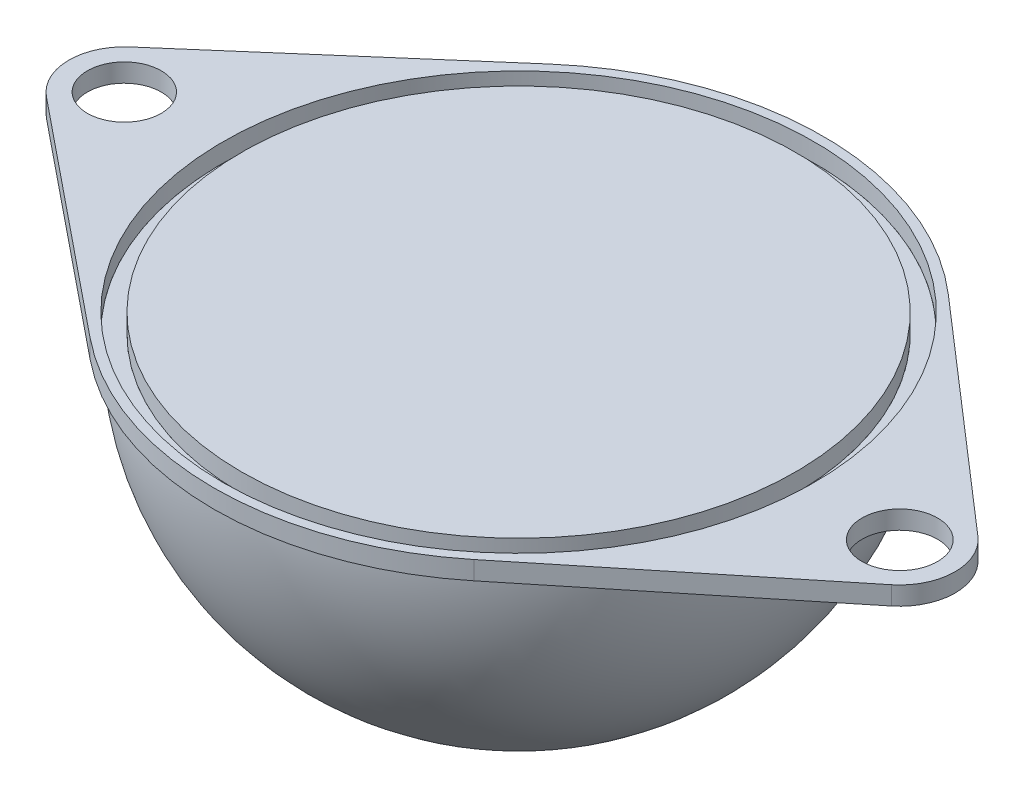
ISO-10303-21;
HEADER;
FILE_DESCRIPTION(('STEP AP214'),'2;1');
FILE_NAME('part.step','',(''),(''),'','','');
FILE_SCHEMA(('AUTOMOTIVE_DESIGN { 1 0 10303 214 1 1 1 1 }'));
ENDSEC;
DATA;
#1=APPLICATION_CONTEXT('core data for automotive mechanical design processes');
#2=APPLICATION_PROTOCOL_DEFINITION('international standard','automotive_design',2000,#1);
#3=PRODUCT_CONTEXT('',#1,'mechanical');
#4=PRODUCT('Part','Part','',(#3));
#5=PRODUCT_RELATED_PRODUCT_CATEGORY('part','',(#4));
#6=PRODUCT_DEFINITION_FORMATION('','',#4);
#7=PRODUCT_DEFINITION_CONTEXT('part definition',#1,'design');
#8=PRODUCT_DEFINITION('design','',#6,#7);
#9=PRODUCT_DEFINITION_SHAPE('','',#8);
#10=(LENGTH_UNIT() NAMED_UNIT(*) SI_UNIT(.MILLI.,.METRE.));
#11=(NAMED_UNIT(*) PLANE_ANGLE_UNIT() SI_UNIT($,.RADIAN.));
#12=(NAMED_UNIT(*) SI_UNIT($,.STERADIAN.) SOLID_ANGLE_UNIT());
#13=UNCERTAINTY_MEASURE_WITH_UNIT(LENGTH_MEASURE(1.E-05),#10,'distance_accuracy_value','');
#14=(GEOMETRIC_REPRESENTATION_CONTEXT(3) GLOBAL_UNCERTAINTY_ASSIGNED_CONTEXT((#13)) GLOBAL_UNIT_ASSIGNED_CONTEXT((#10,
#11,#12)) REPRESENTATION_CONTEXT('',''));
#15=CARTESIAN_POINT('',(0.,0.,0.));
#16=DIRECTION('',(0.,0.,1.));
#17=DIRECTION('',(1.,0.,0.));
#18=AXIS2_PLACEMENT_3D('',#15,#16,#17);
#19=CARTESIAN_POINT('',(0.,0.,0.));
#20=DIRECTION('',(-1.,0.,0.));
#21=DIRECTION('',(0.,0.,1.));
#22=AXIS2_PLACEMENT_3D('',#19,#20,#21);
#23=SPHERICAL_SURFACE('',#22,8.);
#24=CARTESIAN_POINT('',(0.,0.,0.));
#25=DIRECTION('',(0.,1.,0.));
#26=DIRECTION('',(0.,0.,1.));
#27=AXIS2_PLACEMENT_3D('',#24,#25,#26);
#28=SPHERICAL_SURFACE('',#27,8.);
#29=CARTESIAN_POINT('',(0.,-7.06664701255129,0.));
#30=DIRECTION('',(0.,1.,0.));
#31=DIRECTION('',(0.,0.,1.));
#32=AXIS2_PLACEMENT_3D('',#29,#30,#31);
#33=CIRCLE('',#32,3.75);
#34=CARTESIAN_POINT('',(0.,-7.06664701255129,3.75));
#35=VERTEX_POINT('',#34);
#36=EDGE_CURVE('E84',#35,#35,#33,.T.);
#37=ORIENTED_EDGE('',*,*,#36,.T.);
#38=EDGE_LOOP('',(#37));
#39=FACE_BOUND('',#38,.T.);
#40=CARTESIAN_POINT('',(0.,0.,0.));
#41=DIRECTION('',(0.,-1.,0.));
#42=DIRECTION('',(0.,0.,-1.));
#43=AXIS2_PLACEMENT_3D('',#40,#41,#42);
#44=CIRCLE('',#43,8.);
#45=CARTESIAN_POINT('',(0.,0.,-8.));
#46=VERTEX_POINT('',#45);
#47=EDGE_CURVE('E78',#46,#46,#44,.T.);
#48=ORIENTED_EDGE('',*,*,#47,.T.);
#49=EDGE_LOOP('',(#48));
#50=FACE_BOUND('',#49,.T.);
#51=ADVANCED_FACE('F71',(#39,#50),#28,.T.);
#52=CARTESIAN_POINT('',(0.,0.,0.));
#53=DIRECTION('',(-1.,0.,0.));
#54=DIRECTION('',(0.,0.,1.));
#55=AXIS2_PLACEMENT_3D('',#52,#53,#54);
#56=SPHERICAL_SURFACE('',#55,7.5);
#57=CARTESIAN_POINT('',(0.,0.,0.));
#58=DIRECTION('',(0.,1.,0.));
#59=DIRECTION('',(0.,0.,1.));
#60=AXIS2_PLACEMENT_3D('',#57,#58,#59);
#61=SPHERICAL_SURFACE('',#60,7.5);
#62=CARTESIAN_POINT('',(0.,-6.49519052838329,0.));
#63=DIRECTION('',(0.,1.,0.));
#64=DIRECTION('',(0.,0.,1.));
#65=AXIS2_PLACEMENT_3D('',#62,#63,#64);
#66=CIRCLE('',#65,3.75);
#67=CARTESIAN_POINT('',(0.,-6.49519052838329,3.75));
#68=VERTEX_POINT('',#67);
#69=EDGE_CURVE('E74',#68,#68,#66,.F.);
#70=ORIENTED_EDGE('',*,*,#69,.T.);
#71=EDGE_LOOP('',(#70));
#72=FACE_BOUND('',#71,.T.);
#73=CARTESIAN_POINT('',(0.,0.,0.));
#74=DIRECTION('',(0.,-1.,0.));
#75=DIRECTION('',(0.,0.,-1.));
#76=AXIS2_PLACEMENT_3D('',#73,#74,#75);
#77=CIRCLE('',#76,7.5);
#78=CARTESIAN_POINT('',(0.,0.,-7.5));
#79=VERTEX_POINT('',#78);
#80=EDGE_CURVE('E12',#79,#79,#77,.T.);
#81=ORIENTED_EDGE('',*,*,#80,.F.);
#82=EDGE_LOOP('',(#81));
#83=FACE_BOUND('',#82,.T.);
#84=ADVANCED_FACE('F91',(#72,#83),#61,.F.);
#85=CARTESIAN_POINT('',(0.,0.,0.));
#86=DIRECTION('',(0.,-1.,0.));
#87=DIRECTION('',(0.,0.,-1.));
#88=AXIS2_PLACEMENT_3D('',#85,#86,#87);
#89=PLANE('',#88);
#90=ORIENTED_EDGE('',*,*,#80,.T.);
#91=EDGE_LOOP('',(#90));
#92=FACE_BOUND('',#91,.T.);
#93=ORIENTED_EDGE('',*,*,#47,.F.);
#94=EDGE_LOOP('',(#93));
#95=FACE_BOUND('',#94,.T.);
#96=ADVANCED_FACE('F96',(#92,#95),#89,.F.);
#97=CARTESIAN_POINT('',(0.,-8.0005,0.));
#98=DIRECTION('',(0.,1.,0.));
#99=DIRECTION('',(0.,0.,1.));
#100=AXIS2_PLACEMENT_3D('',#97,#98,#99);
#101=CYLINDRICAL_SURFACE('',#100,3.75);
#102=ORIENTED_EDGE('',*,*,#36,.F.);
#103=EDGE_LOOP('',(#102));
#104=FACE_BOUND('',#103,.T.);
#105=ORIENTED_EDGE('',*,*,#69,.F.);
#106=EDGE_LOOP('',(#105));
#107=FACE_BOUND('',#106,.T.);
#108=ADVANCED_FACE('F94',(#104,#107),#101,.F.);
#109=CLOSED_SHELL('',(#51,#84,#96,#108));
#110=MANIFOLD_SOLID_BREP('B2',#109);
#111=CARTESIAN_POINT('',(0.,0.5,0.));
#112=DIRECTION('',(0.,-1.,0.));
#113=DIRECTION('',(0.,0.,-1.));
#114=AXIS2_PLACEMENT_3D('',#111,#112,#113);
#115=CYLINDRICAL_SURFACE('',#114,7.5);
#116=CARTESIAN_POINT('',(0.,0.5,0.));
#117=DIRECTION('',(0.,1.,0.));
#118=DIRECTION('',(0.,0.,1.));
#119=AXIS2_PLACEMENT_3D('',#116,#117,#118);
#120=CIRCLE('',#119,7.5);
#121=CARTESIAN_POINT('',(0.,0.5,7.5));
#122=VERTEX_POINT('',#121);
#123=EDGE_CURVE('E70',#122,#122,#120,.T.);
#124=ORIENTED_EDGE('',*,*,#123,.F.);
#125=EDGE_LOOP('',(#124));
#126=FACE_BOUND('',#125,.T.);
#127=CARTESIAN_POINT('',(0.,0.,0.));
#128=DIRECTION('',(0.,1.,0.));
#129=DIRECTION('',(0.,0.,1.));
#130=AXIS2_PLACEMENT_3D('',#127,#128,#129);
#131=CIRCLE('',#130,7.5);
#132=CARTESIAN_POINT('',(0.,0.,7.5));
#133=VERTEX_POINT('',#132);
#134=EDGE_CURVE('E148',#133,#133,#131,.T.);
#135=ORIENTED_EDGE('',*,*,#134,.T.);
#136=EDGE_LOOP('',(#135));
#137=FACE_BOUND('',#136,.T.);
#138=ADVANCED_FACE('F145',(#126,#137),#115,.T.);
#139=CARTESIAN_POINT('',(0.,0.5,0.));
#140=DIRECTION('',(0.,1.,0.));
#141=DIRECTION('',(0.,0.,1.));
#142=AXIS2_PLACEMENT_3D('',#139,#140,#141);
#143=PLANE('',#142);
#144=ORIENTED_EDGE('',*,*,#123,.T.);
#145=EDGE_LOOP('',(#144));
#146=FACE_BOUND('',#145,.T.);
#147=ADVANCED_FACE('F160',(#146),#143,.T.);
#148=CARTESIAN_POINT('',(0.,0.,0.));
#149=DIRECTION('',(0.,1.,0.));
#150=DIRECTION('',(0.,0.,1.));
#151=AXIS2_PLACEMENT_3D('',#148,#149,#150);
#152=PLANE('',#151);
#153=ORIENTED_EDGE('',*,*,#134,.F.);
#154=EDGE_LOOP('',(#153));
#155=FACE_BOUND('',#154,.T.);
#156=ADVANCED_FACE('F158',(#155),#152,.F.);
#157=CLOSED_SHELL('',(#138,#147,#156));
#158=MANIFOLD_SOLID_BREP('B7',#157);
#159=CARTESIAN_POINT('',(5.19545363793906,0.5,6.40856937982464));
#160=DIRECTION('',(0.629751956113825,0.,0.776796288463591));
#161=DIRECTION('',(0.776796288463591,0.,-0.629751956113825));
#162=AXIS2_PLACEMENT_3D('',#159,#160,#161);
#163=PLANE('',#162);
#164=DIRECTION('',(-0.776796288463591,0.,0.629751956113825));
#165=VECTOR('',#164,1.);
#166=CARTESIAN_POINT('',(5.19545363793906,0.,6.40856937982464));
#167=LINE('',#166,#165);
#168=CARTESIAN_POINT('',(11.444761941296,0.,1.34222935368813));
#169=VERTEX_POINT('',#168);
#170=CARTESIAN_POINT('',(5.19545363793906,0.,6.40856937982464));
#171=VERTEX_POINT('',#170);
#172=EDGE_CURVE('E315',#169,#171,#167,.T.);
#173=ORIENTED_EDGE('',*,*,#172,.F.);
#174=DIRECTION('',(0.,-1.,0.));
#175=VECTOR('',#174,1.);
#176=CARTESIAN_POINT('',(11.444761941296,0.5,1.34222935368813));
#177=LINE('',#176,#175);
#178=CARTESIAN_POINT('',(11.444761941296,0.5,1.34222935368813));
#179=VERTEX_POINT('',#178);
#180=EDGE_CURVE('E143',#179,#169,#177,.T.);
#181=ORIENTED_EDGE('',*,*,#180,.F.);
#182=DIRECTION('',(-0.776796288463591,0.,0.629751956113825));
#183=VECTOR('',#182,1.);
#184=CARTESIAN_POINT('',(5.19545363793906,0.5,6.40856937982464));
#185=LINE('',#184,#183);
#186=CARTESIAN_POINT('',(5.19545363793906,0.5,6.40856937982464));
#187=VERTEX_POINT('',#186);
#188=EDGE_CURVE('E392',#179,#187,#185,.T.);
#189=ORIENTED_EDGE('',*,*,#188,.T.);
#190=DIRECTION('',(0.,-1.,0.));
#191=VECTOR('',#190,1.);
#192=CARTESIAN_POINT('',(5.19545363793906,0.5,6.40856937982464));
#193=LINE('',#192,#191);
#194=EDGE_CURVE('E243',#187,#171,#193,.T.);
#195=ORIENTED_EDGE('',*,*,#194,.T.);
#196=EDGE_LOOP('',(#173,#181,#189,#195));
#197=FACE_BOUND('',#196,.T.);
#198=ADVANCED_FACE('F192',(#197),#163,.T.);
#199=CARTESIAN_POINT('',(10.5,0.5,0.176869623788843));
#200=DIRECTION('',(0.,-1.,0.));
#201=DIRECTION('',(0.,0.,-1.));
#202=AXIS2_PLACEMENT_3D('',#199,#200,#201);
#203=CYLINDRICAL_SURFACE('',#202,1.50021279350372);
#204=CARTESIAN_POINT('',(10.5,0.,0.176869623788843));
#205=DIRECTION('',(0.,1.,0.));
#206=DIRECTION('',(0.,0.,1.));
#207=AXIS2_PLACEMENT_3D('',#204,#205,#206);
#208=CIRCLE('',#207,1.50021279350372);
#209=CARTESIAN_POINT('',(11.4834751449145,0.,-0.956009480585321));
#210=VERTEX_POINT('',#209);
#211=EDGE_CURVE('E309',#210,#169,#208,.F.);
#212=ORIENTED_EDGE('',*,*,#211,.F.);
#213=DIRECTION('',(0.,-1.,0.));
#214=VECTOR('',#213,1.);
#215=CARTESIAN_POINT('',(11.4834751449145,0.5,-0.956009480585321));
#216=LINE('',#215,#214);
#217=CARTESIAN_POINT('',(11.4834751449145,0.5,-0.956009480585321));
#218=VERTEX_POINT('',#217);
#219=EDGE_CURVE('E201',#218,#210,#216,.T.);
#220=ORIENTED_EDGE('',*,*,#219,.F.);
#221=CARTESIAN_POINT('',(10.5,0.5,0.176869623788843));
#222=DIRECTION('',(0.,1.,0.));
#223=DIRECTION('',(0.,0.,1.));
#224=AXIS2_PLACEMENT_3D('',#221,#222,#223);
#225=CIRCLE('',#224,1.50021279350372);
#226=EDGE_CURVE('E394',#218,#179,#225,.F.);
#227=ORIENTED_EDGE('',*,*,#226,.T.);
#228=ORIENTED_EDGE('',*,*,#180,.T.);
#229=EDGE_LOOP('',(#212,#220,#227,#228));
#230=FACE_BOUND('',#229,.T.);
#231=ADVANCED_FACE('F314',(#230),#203,.T.);
#232=CARTESIAN_POINT('',(5.40834605642536,0.5,-6.22995127861754));
#233=DIRECTION('',(-0.655557097748529,0.,0.755145609529398));
#234=DIRECTION('',(0.755145609529398,0.,0.655557097748529));
#235=AXIS2_PLACEMENT_3D('',#232,#233,#234);
#236=PLANE('',#235);
#237=DIRECTION('',(-0.755145609529398,0.,-0.655557097748529));
#238=VECTOR('',#237,1.);
#239=CARTESIAN_POINT('',(5.40834605642536,0.,-6.22995127861754));
#240=LINE('',#239,#238);
#241=CARTESIAN_POINT('',(5.40834605642536,0.,-6.22995127861754));
#242=VERTEX_POINT('',#241);
#243=EDGE_CURVE('E299',#210,#242,#240,.T.);
#244=ORIENTED_EDGE('',*,*,#243,.T.);
#245=DIRECTION('',(0.,-1.,0.));
#246=VECTOR('',#245,1.);
#247=CARTESIAN_POINT('',(5.40834605642536,0.5,-6.22995127861754));
#248=LINE('',#247,#246);
#249=CARTESIAN_POINT('',(5.40834605642536,0.5,-6.22995127861754));
#250=VERTEX_POINT('',#249);
#251=EDGE_CURVE('E291',#250,#242,#248,.T.);
#252=ORIENTED_EDGE('',*,*,#251,.F.);
#253=DIRECTION('',(-0.755145609529398,0.,-0.655557097748529));
#254=VECTOR('',#253,1.);
#255=CARTESIAN_POINT('',(5.40834605642536,0.5,-6.22995127861754));
#256=LINE('',#255,#254);
#257=EDGE_CURVE('E301',#218,#250,#256,.T.);
#258=ORIENTED_EDGE('',*,*,#257,.F.);
#259=ORIENTED_EDGE('',*,*,#219,.T.);
#260=EDGE_LOOP('',(#244,#252,#258,#259));
#261=FACE_BOUND('',#260,.T.);
#262=ADVANCED_FACE('F297',(#261),#236,.F.);
#263=CARTESIAN_POINT('',(0.,0.5,0.));
#264=DIRECTION('',(0.,-1.,0.));
#265=DIRECTION('',(0.,0.,-1.));
#266=AXIS2_PLACEMENT_3D('',#263,#264,#265);
#267=CYLINDRICAL_SURFACE('',#266,8.25000000000001);
#268=CARTESIAN_POINT('',(0.,0.,0.));
#269=DIRECTION('',(0.,1.,0.));
#270=DIRECTION('',(0.,0.,1.));
#271=AXIS2_PLACEMENT_3D('',#268,#269,#270);
#272=CIRCLE('',#271,8.25000000000001);
#273=CARTESIAN_POINT('',(-5.40834605642536,0.,-6.22995127861754));
#274=VERTEX_POINT('',#273);
#275=EDGE_CURVE('E312',#242,#274,#272,.T.);
#276=ORIENTED_EDGE('',*,*,#275,.T.);
#277=DIRECTION('',(0.,-1.,0.));
#278=VECTOR('',#277,1.);
#279=CARTESIAN_POINT('',(-5.40834605642536,0.5,-6.22995127861754));
#280=LINE('',#279,#278);
#281=CARTESIAN_POINT('',(-5.40834605642536,0.5,-6.22995127861754));
#282=VERTEX_POINT('',#281);
#283=EDGE_CURVE('E285',#282,#274,#280,.T.);
#284=ORIENTED_EDGE('',*,*,#283,.F.);
#285=CARTESIAN_POINT('',(0.,0.5,0.));
#286=DIRECTION('',(0.,1.,0.));
#287=DIRECTION('',(0.,0.,1.));
#288=AXIS2_PLACEMENT_3D('',#285,#286,#287);
#289=CIRCLE('',#288,8.25000000000001);
#290=EDGE_CURVE('E400',#250,#282,#289,.T.);
#291=ORIENTED_EDGE('',*,*,#290,.F.);
#292=ORIENTED_EDGE('',*,*,#251,.T.);
#293=EDGE_LOOP('',(#276,#284,#291,#292));
#294=FACE_BOUND('',#293,.T.);
#295=ADVANCED_FACE('F366',(#294),#267,.T.);
#296=CARTESIAN_POINT('',(-5.40834605642537,0.5,-6.22995127861754));
#297=DIRECTION('',(-0.655557097748529,0.,-0.755145609529398));
#298=DIRECTION('',(-0.755145609529398,0.,0.655557097748529));
#299=AXIS2_PLACEMENT_3D('',#296,#297,#298);
#300=PLANE('',#299);
#301=DIRECTION('',(0.755145609529398,0.,-0.655557097748529));
#302=VECTOR('',#301,1.);
#303=CARTESIAN_POINT('',(-5.40834605642537,0.,-6.22995127861754));
#304=LINE('',#303,#302);
#305=CARTESIAN_POINT('',(-11.4834751449145,0.,-0.956009480585321));
#306=VERTEX_POINT('',#305);
#307=EDGE_CURVE('E322',#306,#274,#304,.T.);
#308=ORIENTED_EDGE('',*,*,#307,.F.);
#309=DIRECTION('',(0.,-1.,0.));
#310=VECTOR('',#309,1.);
#311=CARTESIAN_POINT('',(-11.4834751449145,0.5,-0.956009480585321));
#312=LINE('',#311,#310);
#313=CARTESIAN_POINT('',(-11.4834751449145,0.5,-0.956009480585321));
#314=VERTEX_POINT('',#313);
#315=EDGE_CURVE('E283',#314,#306,#312,.T.);
#316=ORIENTED_EDGE('',*,*,#315,.F.);
#317=DIRECTION('',(0.755145609529398,0.,-0.655557097748529));
#318=VECTOR('',#317,1.);
#319=CARTESIAN_POINT('',(-5.40834605642537,0.5,-6.22995127861754));
#320=LINE('',#319,#318);
#321=EDGE_CURVE('E277',#314,#282,#320,.T.);
#322=ORIENTED_EDGE('',*,*,#321,.T.);
#323=ORIENTED_EDGE('',*,*,#283,.T.);
#324=EDGE_LOOP('',(#308,#316,#322,#323));
#325=FACE_BOUND('',#324,.T.);
#326=ADVANCED_FACE('F369',(#325),#300,.T.);
#327=CARTESIAN_POINT('',(-10.5,0.5,0.176869623788846));
#328=DIRECTION('',(0.,-1.,0.));
#329=DIRECTION('',(0.,0.,-1.));
#330=AXIS2_PLACEMENT_3D('',#327,#328,#329);
#331=CYLINDRICAL_SURFACE('',#330,1.50021279350372);
#332=CARTESIAN_POINT('',(-10.5,0.,0.176869623788846));
#333=DIRECTION('',(0.,1.,0.));
#334=DIRECTION('',(0.,0.,1.));
#335=AXIS2_PLACEMENT_3D('',#332,#333,#334);
#336=CIRCLE('',#335,1.50021279350372);
#337=CARTESIAN_POINT('',(-11.4447619412959,0.,1.34222935368813));
#338=VERTEX_POINT('',#337);
#339=EDGE_CURVE('E282',#306,#338,#336,.T.);
#340=ORIENTED_EDGE('',*,*,#339,.T.);
#341=DIRECTION('',(0.,-1.,0.));
#342=VECTOR('',#341,1.);
#343=CARTESIAN_POINT('',(-11.4447619412959,0.5,1.34222935368813));
#344=LINE('',#343,#342);
#345=CARTESIAN_POINT('',(-11.4447619412959,0.5,1.34222935368813));
#346=VERTEX_POINT('',#345);
#347=EDGE_CURVE('E267',#346,#338,#344,.T.);
#348=ORIENTED_EDGE('',*,*,#347,.F.);
#349=CARTESIAN_POINT('',(-10.5,0.5,0.176869623788846));
#350=DIRECTION('',(0.,1.,0.));
#351=DIRECTION('',(0.,0.,1.));
#352=AXIS2_PLACEMENT_3D('',#349,#350,#351);
#353=CIRCLE('',#352,1.50021279350372);
#354=EDGE_CURVE('E270',#314,#346,#353,.T.);
#355=ORIENTED_EDGE('',*,*,#354,.F.);
#356=ORIENTED_EDGE('',*,*,#315,.T.);
#357=EDGE_LOOP('',(#340,#348,#355,#356));
#358=FACE_BOUND('',#357,.T.);
#359=ADVANCED_FACE('F280',(#358),#331,.T.);
#360=CARTESIAN_POINT('',(-5.19545363793906,0.5,6.40856937982463));
#361=DIRECTION('',(0.629751956113825,0.,-0.776796288463591));
#362=DIRECTION('',(-0.776796288463591,0.,-0.629751956113825));
#363=AXIS2_PLACEMENT_3D('',#360,#361,#362);
#364=PLANE('',#363);
#365=DIRECTION('',(0.776796288463591,0.,0.629751956113825));
#366=VECTOR('',#365,1.);
#367=CARTESIAN_POINT('',(-5.19545363793906,0.,6.40856937982463));
#368=LINE('',#367,#366);
#369=CARTESIAN_POINT('',(-5.19545363793906,0.,6.40856937982464));
#370=VERTEX_POINT('',#369);
#371=EDGE_CURVE('E325',#338,#370,#368,.T.);
#372=ORIENTED_EDGE('',*,*,#371,.T.);
#373=DIRECTION('',(0.,-1.,0.));
#374=VECTOR('',#373,1.);
#375=CARTESIAN_POINT('',(-5.19545363793906,0.5,6.40856937982464));
#376=LINE('',#375,#374);
#377=CARTESIAN_POINT('',(-5.19545363793906,0.5,6.40856937982464));
#378=VERTEX_POINT('',#377);
#379=EDGE_CURVE('E269',#378,#370,#376,.T.);
#380=ORIENTED_EDGE('',*,*,#379,.F.);
#381=DIRECTION('',(0.776796288463591,0.,0.629751956113825));
#382=VECTOR('',#381,1.);
#383=CARTESIAN_POINT('',(-5.19545363793906,0.5,6.40856937982463));
#384=LINE('',#383,#382);
#385=EDGE_CURVE('E262',#346,#378,#384,.T.);
#386=ORIENTED_EDGE('',*,*,#385,.F.);
#387=ORIENTED_EDGE('',*,*,#347,.T.);
#388=EDGE_LOOP('',(#372,#380,#386,#387));
#389=FACE_BOUND('',#388,.T.);
#390=ADVANCED_FACE('F265',(#389),#364,.F.);
#391=CARTESIAN_POINT('',(0.,0.5,0.));
#392=DIRECTION('',(0.,-1.,0.));
#393=DIRECTION('',(0.,0.,-1.));
#394=AXIS2_PLACEMENT_3D('',#391,#392,#393);
#395=CYLINDRICAL_SURFACE('',#394,8.25000000000001);
#396=CARTESIAN_POINT('',(0.,0.,0.));
#397=DIRECTION('',(0.,1.,0.));
#398=DIRECTION('',(0.,0.,1.));
#399=AXIS2_PLACEMENT_3D('',#396,#397,#398);
#400=CIRCLE('',#399,8.25000000000001);
#401=EDGE_CURVE('E236',#370,#171,#400,.T.);
#402=ORIENTED_EDGE('',*,*,#401,.T.);
#403=ORIENTED_EDGE('',*,*,#194,.F.);
#404=CARTESIAN_POINT('',(0.,0.5,0.));
#405=DIRECTION('',(0.,1.,0.));
#406=DIRECTION('',(0.,0.,1.));
#407=AXIS2_PLACEMENT_3D('',#404,#405,#406);
#408=CIRCLE('',#407,8.25000000000001);
#409=EDGE_CURVE('E209',#378,#187,#408,.T.);
#410=ORIENTED_EDGE('',*,*,#409,.F.);
#411=ORIENTED_EDGE('',*,*,#379,.T.);
#412=EDGE_LOOP('',(#402,#403,#410,#411));
#413=FACE_BOUND('',#412,.T.);
#414=ADVANCED_FACE('F346',(#413),#395,.T.);
#415=CARTESIAN_POINT('',(10.5,0.5,0.176869623788843));
#416=DIRECTION('',(0.,-1.,0.));
#417=DIRECTION('',(0.,0.,-1.));
#418=AXIS2_PLACEMENT_3D('',#415,#416,#417);
#419=CYLINDRICAL_SURFACE('',#418,1.02306005645789);
#420=CARTESIAN_POINT('',(10.5,0.5,0.176869623788843));
#421=DIRECTION('',(0.,1.,0.));
#422=DIRECTION('',(0.,0.,1.));
#423=AXIS2_PLACEMENT_3D('',#420,#421,#422);
#424=CIRCLE('',#423,1.02306005645789);
#425=CARTESIAN_POINT('',(10.5,0.5,1.19992968024673));
#426=VERTEX_POINT('',#425);
#427=EDGE_CURVE('E391',#426,#426,#424,.T.);
#428=ORIENTED_EDGE('',*,*,#427,.T.);
#429=EDGE_LOOP('',(#428));
#430=FACE_BOUND('',#429,.T.);
#431=CARTESIAN_POINT('',(10.5,0.,0.176869623788843));
#432=DIRECTION('',(0.,1.,0.));
#433=DIRECTION('',(0.,0.,1.));
#434=AXIS2_PLACEMENT_3D('',#431,#432,#433);
#435=CIRCLE('',#434,1.02306005645789);
#436=CARTESIAN_POINT('',(10.5,0.,1.19992968024673));
#437=VERTEX_POINT('',#436);
#438=EDGE_CURVE('E317',#437,#437,#435,.T.);
#439=ORIENTED_EDGE('',*,*,#438,.F.);
#440=EDGE_LOOP('',(#439));
#441=FACE_BOUND('',#440,.T.);
#442=ADVANCED_FACE('F344',(#430,#441),#419,.F.);
#443=CARTESIAN_POINT('',(0.,0.5,0.));
#444=DIRECTION('',(0.,-1.,0.));
#445=DIRECTION('',(0.,0.,-1.));
#446=AXIS2_PLACEMENT_3D('',#443,#444,#445);
#447=CYLINDRICAL_SURFACE('',#446,8.);
#448=CARTESIAN_POINT('',(0.,0.5,0.));
#449=DIRECTION('',(0.,1.,0.));
#450=DIRECTION('',(0.,0.,1.));
#451=AXIS2_PLACEMENT_3D('',#448,#449,#450);
#452=CIRCLE('',#451,8.);
#453=CARTESIAN_POINT('',(0.,0.5,8.));
#454=VERTEX_POINT('',#453);
#455=EDGE_CURVE('E330',#454,#454,#452,.T.);
#456=ORIENTED_EDGE('',*,*,#455,.T.);
#457=EDGE_LOOP('',(#456));
#458=FACE_BOUND('',#457,.T.);
#459=CARTESIAN_POINT('',(0.,0.,0.));
#460=DIRECTION('',(0.,1.,0.));
#461=DIRECTION('',(0.,0.,1.));
#462=AXIS2_PLACEMENT_3D('',#459,#460,#461);
#463=CIRCLE('',#462,8.);
#464=CARTESIAN_POINT('',(0.,0.,8.));
#465=VERTEX_POINT('',#464);
#466=EDGE_CURVE('E338',#465,#465,#463,.T.);
#467=ORIENTED_EDGE('',*,*,#466,.F.);
#468=EDGE_LOOP('',(#467));
#469=FACE_BOUND('',#468,.T.);
#470=ADVANCED_FACE('F194',(#458,#469),#447,.F.);
#471=CARTESIAN_POINT('',(-10.5,0.5,0.176869623788846));
#472=DIRECTION('',(0.,-1.,0.));
#473=DIRECTION('',(0.,0.,-1.));
#474=AXIS2_PLACEMENT_3D('',#471,#472,#473);
#475=CYLINDRICAL_SURFACE('',#474,1.);
#476=CARTESIAN_POINT('',(-10.5,0.5,0.176869623788846));
#477=DIRECTION('',(0.,1.,0.));
#478=DIRECTION('',(0.,0.,1.));
#479=AXIS2_PLACEMENT_3D('',#476,#477,#478);
#480=CIRCLE('',#479,1.);
#481=CARTESIAN_POINT('',(-10.5,0.5,1.17686962378885));
#482=VERTEX_POINT('',#481);
#483=EDGE_CURVE('E331',#482,#482,#480,.T.);
#484=ORIENTED_EDGE('',*,*,#483,.T.);
#485=EDGE_LOOP('',(#484));
#486=FACE_BOUND('',#485,.T.);
#487=CARTESIAN_POINT('',(-10.5,0.,0.176869623788846));
#488=DIRECTION('',(0.,1.,0.));
#489=DIRECTION('',(0.,0.,1.));
#490=AXIS2_PLACEMENT_3D('',#487,#488,#489);
#491=CIRCLE('',#490,1.);
#492=CARTESIAN_POINT('',(-10.5,0.,1.17686962378885));
#493=VERTEX_POINT('',#492);
#494=EDGE_CURVE('E328',#493,#493,#491,.T.);
#495=ORIENTED_EDGE('',*,*,#494,.F.);
#496=EDGE_LOOP('',(#495));
#497=FACE_BOUND('',#496,.T.);
#498=ADVANCED_FACE('F352',(#486,#497),#475,.F.);
#499=CARTESIAN_POINT('',(0.,0.5,0.));
#500=DIRECTION('',(0.,1.,0.));
#501=DIRECTION('',(0.,0.,1.));
#502=AXIS2_PLACEMENT_3D('',#499,#500,#501);
#503=PLANE('',#502);
#504=ORIENTED_EDGE('',*,*,#455,.F.);
#505=EDGE_LOOP('',(#504));
#506=FACE_BOUND('',#505,.T.);
#507=ORIENTED_EDGE('',*,*,#427,.F.);
#508=EDGE_LOOP('',(#507));
#509=FACE_BOUND('',#508,.T.);
#510=ORIENTED_EDGE('',*,*,#188,.F.);
#511=ORIENTED_EDGE('',*,*,#226,.F.);
#512=ORIENTED_EDGE('',*,*,#257,.T.);
#513=ORIENTED_EDGE('',*,*,#290,.T.);
#514=ORIENTED_EDGE('',*,*,#321,.F.);
#515=ORIENTED_EDGE('',*,*,#354,.T.);
#516=ORIENTED_EDGE('',*,*,#385,.T.);
#517=ORIENTED_EDGE('',*,*,#409,.T.);
#518=EDGE_LOOP('',(#510,#511,#512,#513,#514,#515,#516,#517));
#519=FACE_BOUND('',#518,.T.);
#520=ORIENTED_EDGE('',*,*,#483,.F.);
#521=EDGE_LOOP('',(#520));
#522=FACE_BOUND('',#521,.T.);
#523=ADVANCED_FACE('F274',(#506,#509,#519,#522),#503,.T.);
#524=CARTESIAN_POINT('',(0.,0.,0.));
#525=DIRECTION('',(0.,1.,0.));
#526=DIRECTION('',(0.,0.,1.));
#527=AXIS2_PLACEMENT_3D('',#524,#525,#526);
#528=PLANE('',#527);
#529=ORIENTED_EDGE('',*,*,#466,.T.);
#530=EDGE_LOOP('',(#529));
#531=FACE_BOUND('',#530,.T.);
#532=ORIENTED_EDGE('',*,*,#438,.T.);
#533=EDGE_LOOP('',(#532));
#534=FACE_BOUND('',#533,.T.);
#535=ORIENTED_EDGE('',*,*,#172,.T.);
#536=ORIENTED_EDGE('',*,*,#401,.F.);
#537=ORIENTED_EDGE('',*,*,#371,.F.);
#538=ORIENTED_EDGE('',*,*,#339,.F.);
#539=ORIENTED_EDGE('',*,*,#307,.T.);
#540=ORIENTED_EDGE('',*,*,#275,.F.);
#541=ORIENTED_EDGE('',*,*,#243,.F.);
#542=ORIENTED_EDGE('',*,*,#211,.T.);
#543=EDGE_LOOP('',(#535,#536,#537,#538,#539,#540,#541,#542));
#544=FACE_BOUND('',#543,.T.);
#545=ORIENTED_EDGE('',*,*,#494,.T.);
#546=EDGE_LOOP('',(#545));
#547=FACE_BOUND('',#546,.T.);
#548=ADVANCED_FACE('F307',(#531,#534,#544,#547),#528,.F.);
#549=CLOSED_SHELL('',(#198,#231,#262,#295,#326,#359,#390,#414,#442,#470,#498,#523,#548));
#550=MANIFOLD_SOLID_BREP('B65',#549);
#551=ADVANCED_BREP_SHAPE_REPRESENTATION('',(#18,#110,#158,#550),#14);
#552=SHAPE_DEFINITION_REPRESENTATION(#9,#551);
ENDSEC;
END-ISO-10303-21;
